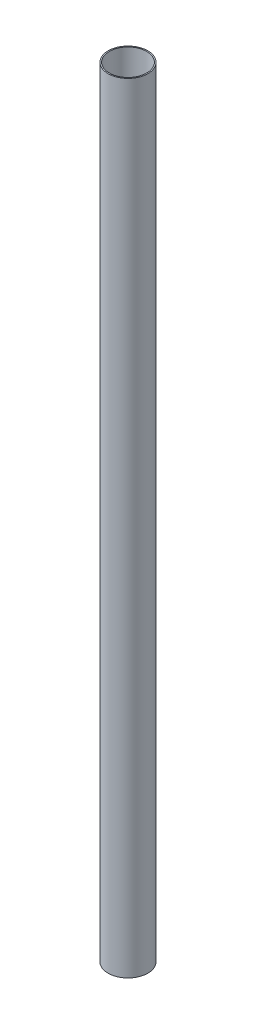
ISO-10303-21;
HEADER;
FILE_DESCRIPTION(('STEP AP214'),'2;1');
FILE_NAME('part.step','',(''),(''),'','','');
FILE_SCHEMA(('AUTOMOTIVE_DESIGN { 1 0 10303 214 1 1 1 1 }'));
ENDSEC;
DATA;
#1=APPLICATION_CONTEXT('core data for automotive mechanical design processes');
#2=APPLICATION_PROTOCOL_DEFINITION('international standard','automotive_design',2000,#1);
#3=PRODUCT_CONTEXT('',#1,'mechanical');
#4=PRODUCT('Part','Part','',(#3));
#5=PRODUCT_RELATED_PRODUCT_CATEGORY('part','',(#4));
#6=PRODUCT_DEFINITION_FORMATION('','',#4);
#7=PRODUCT_DEFINITION_CONTEXT('part definition',#1,'design');
#8=PRODUCT_DEFINITION('design','',#6,#7);
#9=PRODUCT_DEFINITION_SHAPE('','',#8);
#10=(LENGTH_UNIT() NAMED_UNIT(*) SI_UNIT(.MILLI.,.METRE.));
#11=(NAMED_UNIT(*) PLANE_ANGLE_UNIT() SI_UNIT($,.RADIAN.));
#12=(NAMED_UNIT(*) SI_UNIT($,.STERADIAN.) SOLID_ANGLE_UNIT());
#13=UNCERTAINTY_MEASURE_WITH_UNIT(LENGTH_MEASURE(1.E-05),#10,'distance_accuracy_value','');
#14=(GEOMETRIC_REPRESENTATION_CONTEXT(3) GLOBAL_UNCERTAINTY_ASSIGNED_CONTEXT((#13)) GLOBAL_UNIT_ASSIGNED_CONTEXT((#10,
#11,#12)) REPRESENTATION_CONTEXT('',''));
#15=CARTESIAN_POINT('',(0.,0.,0.));
#16=DIRECTION('',(0.,0.,1.));
#17=DIRECTION('',(1.,0.,0.));
#18=AXIS2_PLACEMENT_3D('',#15,#16,#17);
#19=CARTESIAN_POINT('',(0.,500.,0.));
#20=DIRECTION('',(0.,1.,0.));
#21=DIRECTION('',(0.,0.,1.));
#22=AXIS2_PLACEMENT_3D('',#19,#20,#21);
#23=PLANE('',#22);
#24=CARTESIAN_POINT('',(0.,500.,0.));
#25=DIRECTION('',(0.,1.,0.));
#26=DIRECTION('',(0.,0.,1.));
#27=AXIS2_PLACEMENT_3D('',#24,#25,#26);
#28=CIRCLE('',#27,12.75);
#29=CARTESIAN_POINT('',(0.,500.,12.75));
#30=VERTEX_POINT('',#29);
#31=EDGE_CURVE('E10',#30,#30,#28,.T.);
#32=ORIENTED_EDGE('',*,*,#31,.T.);
#33=EDGE_LOOP('',(#32));
#34=FACE_BOUND('',#33,.T.);
#35=CARTESIAN_POINT('',(0.,500.,0.));
#36=DIRECTION('',(0.,1.,0.));
#37=DIRECTION('',(0.,0.,1.));
#38=AXIS2_PLACEMENT_3D('',#35,#36,#37);
#39=CIRCLE('',#38,12.);
#40=CARTESIAN_POINT('',(0.,500.,12.));
#41=VERTEX_POINT('',#40);
#42=EDGE_CURVE('E41',#41,#41,#39,.T.);
#43=ORIENTED_EDGE('',*,*,#42,.F.);
#44=EDGE_LOOP('',(#43));
#45=FACE_BOUND('',#44,.T.);
#46=ADVANCED_FACE('F30',(#34,#45),#23,.T.);
#47=CARTESIAN_POINT('',(0.,0.,0.));
#48=DIRECTION('',(0.,1.,0.));
#49=DIRECTION('',(0.,0.,1.));
#50=AXIS2_PLACEMENT_3D('',#47,#48,#49);
#51=PLANE('',#50);
#52=CARTESIAN_POINT('',(0.,0.,0.));
#53=DIRECTION('',(0.,1.,0.));
#54=DIRECTION('',(0.,0.,1.));
#55=AXIS2_PLACEMENT_3D('',#52,#53,#54);
#56=CIRCLE('',#55,12.75);
#57=CARTESIAN_POINT('',(0.,0.,12.75));
#58=VERTEX_POINT('',#57);
#59=EDGE_CURVE('E34',#58,#58,#56,.T.);
#60=ORIENTED_EDGE('',*,*,#59,.F.);
#61=EDGE_LOOP('',(#60));
#62=FACE_BOUND('',#61,.T.);
#63=CARTESIAN_POINT('',(0.,0.,0.));
#64=DIRECTION('',(0.,1.,0.));
#65=DIRECTION('',(0.,0.,1.));
#66=AXIS2_PLACEMENT_3D('',#63,#64,#65);
#67=CIRCLE('',#66,12.);
#68=CARTESIAN_POINT('',(0.,0.,12.));
#69=VERTEX_POINT('',#68);
#70=EDGE_CURVE('E43',#69,#69,#67,.T.);
#71=ORIENTED_EDGE('',*,*,#70,.T.);
#72=EDGE_LOOP('',(#71));
#73=FACE_BOUND('',#72,.T.);
#74=ADVANCED_FACE('F53',(#62,#73),#51,.F.);
#75=CARTESIAN_POINT('',(0.,500.,0.));
#76=DIRECTION('',(0.,-1.,0.));
#77=DIRECTION('',(0.,0.,-1.));
#78=AXIS2_PLACEMENT_3D('',#75,#76,#77);
#79=CYLINDRICAL_SURFACE('',#78,12.75);
#80=ORIENTED_EDGE('',*,*,#31,.F.);
#81=EDGE_LOOP('',(#80));
#82=FACE_BOUND('',#81,.T.);
#83=ORIENTED_EDGE('',*,*,#59,.T.);
#84=EDGE_LOOP('',(#83));
#85=FACE_BOUND('',#84,.T.);
#86=ADVANCED_FACE('F32',(#82,#85),#79,.T.);
#87=CARTESIAN_POINT('',(0.,500.,0.));
#88=DIRECTION('',(0.,-1.,0.));
#89=DIRECTION('',(0.,0.,-1.));
#90=AXIS2_PLACEMENT_3D('',#87,#88,#89);
#91=CYLINDRICAL_SURFACE('',#90,12.);
#92=ORIENTED_EDGE('',*,*,#42,.T.);
#93=EDGE_LOOP('',(#92));
#94=FACE_BOUND('',#93,.T.);
#95=ORIENTED_EDGE('',*,*,#70,.F.);
#96=EDGE_LOOP('',(#95));
#97=FACE_BOUND('',#96,.T.);
#98=ADVANCED_FACE('F49',(#94,#97),#91,.F.);
#99=CLOSED_SHELL('',(#46,#74,#86,#98));
#100=MANIFOLD_SOLID_BREP('B2',#99);
#101=ADVANCED_BREP_SHAPE_REPRESENTATION('',(#18,#100),#14);
#102=SHAPE_DEFINITION_REPRESENTATION(#9,#101);
ENDSEC;
END-ISO-10303-21;
